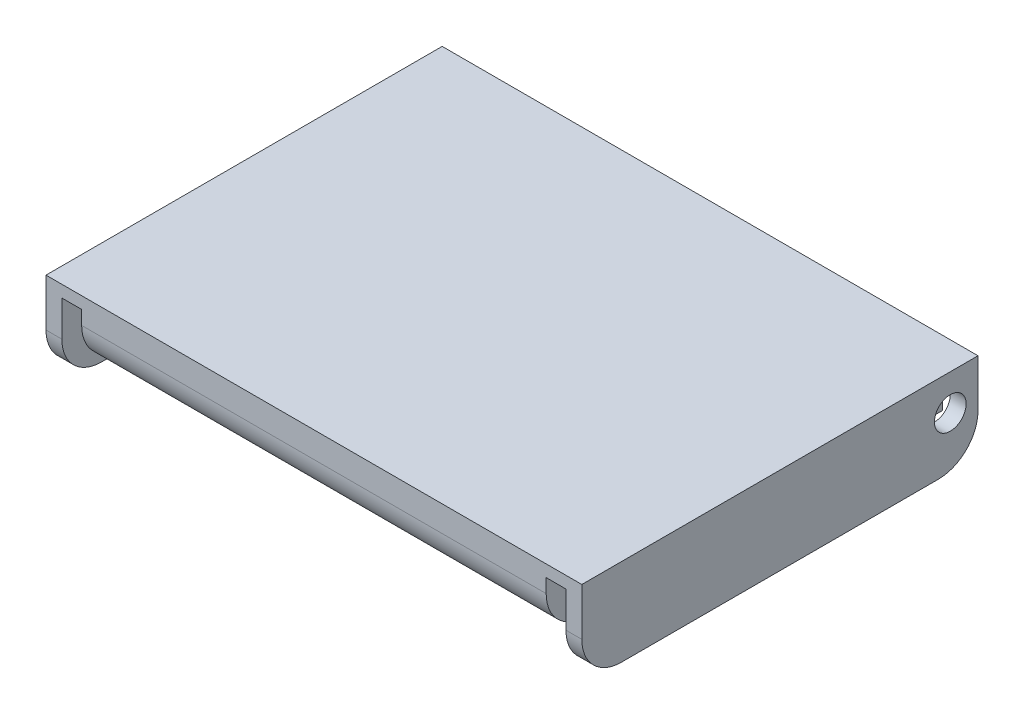
ISO-10303-21;
HEADER;
FILE_DESCRIPTION(('STEP AP214'),'2;1');
FILE_NAME('part.step','',(''),(''),'','','');
FILE_SCHEMA(('AUTOMOTIVE_DESIGN { 1 0 10303 214 1 1 1 1 }'));
ENDSEC;
DATA;
#1=APPLICATION_CONTEXT('core data for automotive mechanical design processes');
#2=APPLICATION_PROTOCOL_DEFINITION('international standard','automotive_design',2000,#1);
#3=PRODUCT_CONTEXT('',#1,'mechanical');
#4=PRODUCT('Part','Part','',(#3));
#5=PRODUCT_RELATED_PRODUCT_CATEGORY('part','',(#4));
#6=PRODUCT_DEFINITION_FORMATION('','',#4);
#7=PRODUCT_DEFINITION_CONTEXT('part definition',#1,'design');
#8=PRODUCT_DEFINITION('design','',#6,#7);
#9=PRODUCT_DEFINITION_SHAPE('','',#8);
#10=(LENGTH_UNIT() NAMED_UNIT(*) SI_UNIT(.MILLI.,.METRE.));
#11=(NAMED_UNIT(*) PLANE_ANGLE_UNIT() SI_UNIT($,.RADIAN.));
#12=(NAMED_UNIT(*) SI_UNIT($,.STERADIAN.) SOLID_ANGLE_UNIT());
#13=UNCERTAINTY_MEASURE_WITH_UNIT(LENGTH_MEASURE(1.E-05),#10,'distance_accuracy_value','');
#14=(GEOMETRIC_REPRESENTATION_CONTEXT(3) GLOBAL_UNCERTAINTY_ASSIGNED_CONTEXT((#13)) GLOBAL_UNIT_ASSIGNED_CONTEXT((#10,
#11,#12)) REPRESENTATION_CONTEXT('',''));
#15=CARTESIAN_POINT('',(0.,0.,0.));
#16=DIRECTION('',(0.,0.,1.));
#17=DIRECTION('',(1.,0.,0.));
#18=AXIS2_PLACEMENT_3D('',#15,#16,#17);
#19=CARTESIAN_POINT('',(0.,10.,-40.));
#20=DIRECTION('',(-1.,0.,0.));
#21=DIRECTION('',(0.,0.,1.));
#22=AXIS2_PLACEMENT_3D('',#19,#20,#21);
#23=CYLINDRICAL_SURFACE('',#22,10.);
#24=CARTESIAN_POINT('',(63.625,10.,-40.));
#25=DIRECTION('',(1.,0.,0.));
#26=DIRECTION('',(0.,0.,-1.));
#27=AXIS2_PLACEMENT_3D('',#24,#25,#26);
#28=CIRCLE('',#27,10.);
#29=CARTESIAN_POINT('',(63.625,10.,-50.));
#30=VERTEX_POINT('',#29);
#31=CARTESIAN_POINT('',(63.625,0.,-40.));
#32=VERTEX_POINT('',#31);
#33=EDGE_CURVE('E334',#30,#32,#28,.F.);
#34=ORIENTED_EDGE('',*,*,#33,.F.);
#35=DIRECTION('',(1.,0.,0.));
#36=VECTOR('',#35,1.);
#37=CARTESIAN_POINT('',(0.,10.,-50.));
#38=LINE('',#37,#36);
#39=CARTESIAN_POINT('',(67.625,10.,-50.));
#40=VERTEX_POINT('',#39);
#41=EDGE_CURVE('E48',#40,#30,#38,.F.);
#42=ORIENTED_EDGE('',*,*,#41,.F.);
#43=CARTESIAN_POINT('',(67.625,10.,-40.));
#44=DIRECTION('',(-1.,0.,0.));
#45=DIRECTION('',(0.,0.,1.));
#46=AXIS2_PLACEMENT_3D('',#43,#44,#45);
#47=CIRCLE('',#46,10.);
#48=CARTESIAN_POINT('',(67.625,0.,-40.));
#49=VERTEX_POINT('',#48);
#50=EDGE_CURVE('E11',#49,#40,#47,.F.);
#51=ORIENTED_EDGE('',*,*,#50,.F.);
#52=DIRECTION('',(1.,0.,0.));
#53=VECTOR('',#52,1.);
#54=CARTESIAN_POINT('',(0.,0.,-40.));
#55=LINE('',#54,#53);
#56=EDGE_CURVE('E338',#32,#49,#55,.T.);
#57=ORIENTED_EDGE('',*,*,#56,.F.);
#58=EDGE_LOOP('',(#34,#42,#51,#57));
#59=FACE_BOUND('',#58,.T.);
#60=ADVANCED_FACE('F39',(#59),#23,.T.);
#61=CARTESIAN_POINT('',(0.,10.,-40.));
#62=DIRECTION('',(-1.,0.,0.));
#63=DIRECTION('',(0.,0.,1.));
#64=AXIS2_PLACEMENT_3D('',#61,#62,#63);
#65=CYLINDRICAL_SURFACE('',#64,10.);
#66=DIRECTION('',(1.,0.,0.));
#67=VECTOR('',#66,1.);
#68=CARTESIAN_POINT('',(0.,0.,-40.));
#69=LINE('',#68,#67);
#70=CARTESIAN_POINT('',(-67.625,0.,-40.));
#71=VERTEX_POINT('',#70);
#72=CARTESIAN_POINT('',(-63.625,0.,-40.));
#73=VERTEX_POINT('',#72);
#74=EDGE_CURVE('E319',#71,#73,#69,.T.);
#75=ORIENTED_EDGE('',*,*,#74,.F.);
#76=CARTESIAN_POINT('',(-67.625,10.,-40.));
#77=DIRECTION('',(1.,0.,0.));
#78=DIRECTION('',(0.,0.,-1.));
#79=AXIS2_PLACEMENT_3D('',#76,#77,#78);
#80=CIRCLE('',#79,10.);
#81=CARTESIAN_POINT('',(-67.625,10.,-50.));
#82=VERTEX_POINT('',#81);
#83=EDGE_CURVE('E331',#82,#71,#80,.F.);
#84=ORIENTED_EDGE('',*,*,#83,.F.);
#85=DIRECTION('',(1.,0.,0.));
#86=VECTOR('',#85,1.);
#87=CARTESIAN_POINT('',(0.,10.,-50.));
#88=LINE('',#87,#86);
#89=CARTESIAN_POINT('',(-63.625,10.,-50.));
#90=VERTEX_POINT('',#89);
#91=EDGE_CURVE('E327',#90,#82,#88,.F.);
#92=ORIENTED_EDGE('',*,*,#91,.F.);
#93=CARTESIAN_POINT('',(-63.625,10.,-40.));
#94=DIRECTION('',(-1.,0.,0.));
#95=DIRECTION('',(0.,0.,1.));
#96=AXIS2_PLACEMENT_3D('',#93,#94,#95);
#97=CIRCLE('',#96,10.);
#98=EDGE_CURVE('E323',#73,#90,#97,.F.);
#99=ORIENTED_EDGE('',*,*,#98,.F.);
#100=EDGE_LOOP('',(#75,#84,#92,#99));
#101=FACE_BOUND('',#100,.T.);
#102=ADVANCED_FACE('F403',(#101),#65,.T.);
#103=CARTESIAN_POINT('',(0.,10.,40.));
#104=DIRECTION('',(1.,0.,0.));
#105=DIRECTION('',(0.,0.,-1.));
#106=AXIS2_PLACEMENT_3D('',#103,#104,#105);
#107=CYLINDRICAL_SURFACE('',#106,10.);
#108=DIRECTION('',(-1.,0.,0.));
#109=VECTOR('',#108,1.);
#110=CARTESIAN_POINT('',(0.,0.,40.));
#111=LINE('',#110,#109);
#112=CARTESIAN_POINT('',(67.625,0.,40.));
#113=VERTEX_POINT('',#112);
#114=CARTESIAN_POINT('',(63.625,0.,40.));
#115=VERTEX_POINT('',#114);
#116=EDGE_CURVE('E305',#113,#115,#111,.T.);
#117=ORIENTED_EDGE('',*,*,#116,.F.);
#118=CARTESIAN_POINT('',(67.625,10.,40.));
#119=DIRECTION('',(-1.,0.,0.));
#120=DIRECTION('',(0.,0.,1.));
#121=AXIS2_PLACEMENT_3D('',#118,#119,#120);
#122=CIRCLE('',#121,10.);
#123=CARTESIAN_POINT('',(67.625,10.,50.));
#124=VERTEX_POINT('',#123);
#125=EDGE_CURVE('E313',#124,#113,#122,.F.);
#126=ORIENTED_EDGE('',*,*,#125,.F.);
#127=DIRECTION('',(-1.,0.,0.));
#128=VECTOR('',#127,1.);
#129=CARTESIAN_POINT('',(0.,10.,50.));
#130=LINE('',#129,#128);
#131=CARTESIAN_POINT('',(63.625,10.,50.));
#132=VERTEX_POINT('',#131);
#133=EDGE_CURVE('E309',#132,#124,#130,.F.);
#134=ORIENTED_EDGE('',*,*,#133,.F.);
#135=CARTESIAN_POINT('',(63.625,10.,40.));
#136=DIRECTION('',(1.,0.,0.));
#137=DIRECTION('',(0.,0.,-1.));
#138=AXIS2_PLACEMENT_3D('',#135,#136,#137);
#139=CIRCLE('',#138,10.);
#140=EDGE_CURVE('E316',#115,#132,#139,.F.);
#141=ORIENTED_EDGE('',*,*,#140,.F.);
#142=EDGE_LOOP('',(#117,#126,#134,#141));
#143=FACE_BOUND('',#142,.T.);
#144=ADVANCED_FACE('F407',(#143),#107,.T.);
#145=CARTESIAN_POINT('',(0.,10.,40.));
#146=DIRECTION('',(1.,0.,0.));
#147=DIRECTION('',(0.,0.,-1.));
#148=AXIS2_PLACEMENT_3D('',#145,#146,#147);
#149=CYLINDRICAL_SURFACE('',#148,10.);
#150=CARTESIAN_POINT('',(-63.625,10.,40.));
#151=DIRECTION('',(-1.,0.,0.));
#152=DIRECTION('',(0.,0.,1.));
#153=AXIS2_PLACEMENT_3D('',#150,#151,#152);
#154=CIRCLE('',#153,10.);
#155=CARTESIAN_POINT('',(-63.625,10.,50.));
#156=VERTEX_POINT('',#155);
#157=CARTESIAN_POINT('',(-63.625,0.,40.));
#158=VERTEX_POINT('',#157);
#159=EDGE_CURVE('E291',#156,#158,#154,.F.);
#160=ORIENTED_EDGE('',*,*,#159,.F.);
#161=DIRECTION('',(-1.,0.,0.));
#162=VECTOR('',#161,1.);
#163=CARTESIAN_POINT('',(0.,10.,50.));
#164=LINE('',#163,#162);
#165=CARTESIAN_POINT('',(-67.625,10.,50.));
#166=VERTEX_POINT('',#165);
#167=EDGE_CURVE('E299',#166,#156,#164,.F.);
#168=ORIENTED_EDGE('',*,*,#167,.F.);
#169=CARTESIAN_POINT('',(-67.625,10.,40.));
#170=DIRECTION('',(1.,0.,0.));
#171=DIRECTION('',(0.,0.,-1.));
#172=AXIS2_PLACEMENT_3D('',#169,#170,#171);
#173=CIRCLE('',#172,10.);
#174=CARTESIAN_POINT('',(-67.625,0.,40.));
#175=VERTEX_POINT('',#174);
#176=EDGE_CURVE('E302',#175,#166,#173,.F.);
#177=ORIENTED_EDGE('',*,*,#176,.F.);
#178=DIRECTION('',(-1.,0.,0.));
#179=VECTOR('',#178,1.);
#180=CARTESIAN_POINT('',(0.,0.,40.));
#181=LINE('',#180,#179);
#182=EDGE_CURVE('E295',#158,#175,#181,.T.);
#183=ORIENTED_EDGE('',*,*,#182,.F.);
#184=EDGE_LOOP('',(#160,#168,#177,#183));
#185=FACE_BOUND('',#184,.T.);
#186=ADVANCED_FACE('F412',(#185),#149,.T.);
#187=CARTESIAN_POINT('',(-58.625,15.5,40.));
#188=DIRECTION('',(-1.,0.,0.));
#189=DIRECTION('',(0.,0.,1.));
#190=AXIS2_PLACEMENT_3D('',#187,#188,#189);
#191=CYLINDRICAL_SURFACE('',#190,10.);
#192=CARTESIAN_POINT('',(58.625,15.5,40.));
#193=DIRECTION('',(-1.,0.,0.));
#194=DIRECTION('',(0.,0.,1.));
#195=AXIS2_PLACEMENT_3D('',#192,#193,#194);
#196=CIRCLE('',#195,10.);
#197=CARTESIAN_POINT('',(58.625,15.5,50.));
#198=VERTEX_POINT('',#197);
#199=CARTESIAN_POINT('',(58.625,5.5,40.));
#200=VERTEX_POINT('',#199);
#201=EDGE_CURVE('E279',#198,#200,#196,.F.);
#202=ORIENTED_EDGE('',*,*,#201,.F.);
#203=DIRECTION('',(-1.,0.,0.));
#204=VECTOR('',#203,1.);
#205=CARTESIAN_POINT('',(67.625,15.5,50.));
#206=LINE('',#205,#204);
#207=CARTESIAN_POINT('',(-58.625,15.5,50.));
#208=VERTEX_POINT('',#207);
#209=EDGE_CURVE('E288',#208,#198,#206,.F.);
#210=ORIENTED_EDGE('',*,*,#209,.F.);
#211=CARTESIAN_POINT('',(-58.625,15.5,40.));
#212=DIRECTION('',(1.,0.,0.));
#213=DIRECTION('',(0.,0.,-1.));
#214=AXIS2_PLACEMENT_3D('',#211,#212,#213);
#215=CIRCLE('',#214,10.);
#216=CARTESIAN_POINT('',(-58.625,5.5,40.));
#217=VERTEX_POINT('',#216);
#218=EDGE_CURVE('E285',#217,#208,#215,.F.);
#219=ORIENTED_EDGE('',*,*,#218,.F.);
#220=DIRECTION('',(-1.,0.,0.));
#221=VECTOR('',#220,1.);
#222=CARTESIAN_POINT('',(-58.625,5.5,40.));
#223=LINE('',#222,#221);
#224=EDGE_CURVE('E163',#200,#217,#223,.T.);
#225=ORIENTED_EDGE('',*,*,#224,.F.);
#226=EDGE_LOOP('',(#202,#210,#219,#225));
#227=FACE_BOUND('',#226,.T.);
#228=ADVANCED_FACE('F419',(#227),#191,.T.);
#229=CARTESIAN_POINT('',(0.,0.,0.));
#230=DIRECTION('',(0.,-1.,0.));
#231=DIRECTION('',(0.,0.,-1.));
#232=AXIS2_PLACEMENT_3D('',#229,#230,#231);
#233=PLANE('',#232);
#234=DIRECTION('',(0.,0.,1.));
#235=VECTOR('',#234,1.);
#236=CARTESIAN_POINT('',(63.625,0.,-50.));
#237=LINE('',#236,#235);
#238=EDGE_CURVE('E205',#32,#115,#237,.T.);
#239=ORIENTED_EDGE('',*,*,#238,.F.);
#240=ORIENTED_EDGE('',*,*,#56,.T.);
#241=DIRECTION('',(0.,0.,-1.));
#242=VECTOR('',#241,1.);
#243=CARTESIAN_POINT('',(67.625,0.,-50.));
#244=LINE('',#243,#242);
#245=EDGE_CURVE('E251',#113,#49,#244,.T.);
#246=ORIENTED_EDGE('',*,*,#245,.F.);
#247=ORIENTED_EDGE('',*,*,#116,.T.);
#248=EDGE_LOOP('',(#239,#240,#246,#247));
#249=FACE_BOUND('',#248,.T.);
#250=ADVANCED_FACE('F423',(#249),#233,.T.);
#251=CARTESIAN_POINT('',(-67.625,22.,-50.));
#252=DIRECTION('',(1.,0.,0.));
#253=DIRECTION('',(0.,0.,-1.));
#254=AXIS2_PLACEMENT_3D('',#251,#252,#253);
#255=PLANE('',#254);
#256=CARTESIAN_POINT('',(-67.625,13.,-43.));
#257=DIRECTION('',(-1.,0.,0.));
#258=DIRECTION('',(0.,0.,1.));
#259=AXIS2_PLACEMENT_3D('',#256,#257,#258);
#260=CIRCLE('',#259,4.);
#261=CARTESIAN_POINT('',(-67.625,13.,-39.));
#262=VERTEX_POINT('',#261);
#263=EDGE_CURVE('E371',#262,#262,#260,.T.);
#264=ORIENTED_EDGE('',*,*,#263,.F.);
#265=EDGE_LOOP('',(#264));
#266=FACE_BOUND('',#265,.T.);
#267=DIRECTION('',(0.,-1.,0.));
#268=VECTOR('',#267,1.);
#269=CARTESIAN_POINT('',(-67.625,22.,-50.));
#270=LINE('',#269,#268);
#271=CARTESIAN_POINT('',(-67.625,22.,-50.));
#272=VERTEX_POINT('',#271);
#273=EDGE_CURVE('E260',#272,#82,#270,.T.);
#274=ORIENTED_EDGE('',*,*,#273,.T.);
#275=ORIENTED_EDGE('',*,*,#83,.T.);
#276=DIRECTION('',(0.,0.,1.));
#277=VECTOR('',#276,1.);
#278=CARTESIAN_POINT('',(-67.625,0.,-50.));
#279=LINE('',#278,#277);
#280=EDGE_CURVE('E212',#71,#175,#279,.T.);
#281=ORIENTED_EDGE('',*,*,#280,.T.);
#282=ORIENTED_EDGE('',*,*,#176,.T.);
#283=DIRECTION('',(0.,-1.,0.));
#284=VECTOR('',#283,1.);
#285=CARTESIAN_POINT('',(-67.625,22.,50.));
#286=LINE('',#285,#284);
#287=CARTESIAN_POINT('',(-67.625,22.,50.));
#288=VERTEX_POINT('',#287);
#289=EDGE_CURVE('E275',#288,#166,#286,.T.);
#290=ORIENTED_EDGE('',*,*,#289,.F.);
#291=DIRECTION('',(0.,0.,1.));
#292=VECTOR('',#291,1.);
#293=CARTESIAN_POINT('',(-67.625,22.,-50.));
#294=LINE('',#293,#292);
#295=EDGE_CURVE('E246',#272,#288,#294,.T.);
#296=ORIENTED_EDGE('',*,*,#295,.F.);
#297=EDGE_LOOP('',(#274,#275,#281,#282,#290,#296));
#298=FACE_BOUND('',#297,.T.);
#299=ADVANCED_FACE('F425',(#266,#298),#255,.F.);
#300=CARTESIAN_POINT('',(67.625,22.,50.));
#301=DIRECTION('',(0.,0.,-1.));
#302=DIRECTION('',(-1.,0.,0.));
#303=AXIS2_PLACEMENT_3D('',#300,#301,#302);
#304=PLANE('',#303);
#305=DIRECTION('',(0.,1.,0.));
#306=VECTOR('',#305,1.);
#307=CARTESIAN_POINT('',(63.625,19.,50.));
#308=LINE('',#307,#306);
#309=CARTESIAN_POINT('',(63.625,19.,50.));
#310=VERTEX_POINT('',#309);
#311=EDGE_CURVE('E228',#132,#310,#308,.T.);
#312=ORIENTED_EDGE('',*,*,#311,.F.);
#313=ORIENTED_EDGE('',*,*,#133,.T.);
#314=DIRECTION('',(0.,-1.,0.));
#315=VECTOR('',#314,1.);
#316=CARTESIAN_POINT('',(67.625,22.,50.));
#317=LINE('',#316,#315);
#318=CARTESIAN_POINT('',(67.625,22.,50.));
#319=VERTEX_POINT('',#318);
#320=EDGE_CURVE('E271',#319,#124,#317,.T.);
#321=ORIENTED_EDGE('',*,*,#320,.F.);
#322=DIRECTION('',(1.,0.,0.));
#323=VECTOR('',#322,1.);
#324=CARTESIAN_POINT('',(67.625,22.,50.));
#325=LINE('',#324,#323);
#326=EDGE_CURVE('E250',#288,#319,#325,.T.);
#327=ORIENTED_EDGE('',*,*,#326,.F.);
#328=ORIENTED_EDGE('',*,*,#289,.T.);
#329=ORIENTED_EDGE('',*,*,#167,.T.);
#330=DIRECTION('',(0.,-1.,0.));
#331=VECTOR('',#330,1.);
#332=CARTESIAN_POINT('',(-63.625,19.,50.));
#333=LINE('',#332,#331);
#334=CARTESIAN_POINT('',(-63.625,19.,50.));
#335=VERTEX_POINT('',#334);
#336=EDGE_CURVE('E188',#335,#156,#333,.T.);
#337=ORIENTED_EDGE('',*,*,#336,.F.);
#338=DIRECTION('',(-1.,0.,0.));
#339=VECTOR('',#338,1.);
#340=CARTESIAN_POINT('',(-63.625,19.,50.));
#341=LINE('',#340,#339);
#342=CARTESIAN_POINT('',(-58.625,19.,50.));
#343=VERTEX_POINT('',#342);
#344=EDGE_CURVE('E195',#343,#335,#341,.T.);
#345=ORIENTED_EDGE('',*,*,#344,.F.);
#346=DIRECTION('',(0.,1.,0.));
#347=VECTOR('',#346,1.);
#348=CARTESIAN_POINT('',(-58.625,19.,50.));
#349=LINE('',#348,#347);
#350=EDGE_CURVE('E202',#208,#343,#349,.T.);
#351=ORIENTED_EDGE('',*,*,#350,.F.);
#352=ORIENTED_EDGE('',*,*,#209,.T.);
#353=DIRECTION('',(0.,-1.,0.));
#354=VECTOR('',#353,1.);
#355=CARTESIAN_POINT('',(58.625,19.,50.));
#356=LINE('',#355,#354);
#357=CARTESIAN_POINT('',(58.625,19.,50.));
#358=VERTEX_POINT('',#357);
#359=EDGE_CURVE('E222',#358,#198,#356,.T.);
#360=ORIENTED_EDGE('',*,*,#359,.F.);
#361=DIRECTION('',(-1.,0.,0.));
#362=VECTOR('',#361,1.);
#363=CARTESIAN_POINT('',(63.625,19.,50.));
#364=LINE('',#363,#362);
#365=EDGE_CURVE('E231',#310,#358,#364,.T.);
#366=ORIENTED_EDGE('',*,*,#365,.F.);
#367=EDGE_LOOP('',(#312,#313,#321,#327,#328,#329,#337,#345,#351,#352,#360,#366));
#368=FACE_BOUND('',#367,.T.);
#369=ADVANCED_FACE('F428',(#368),#304,.F.);
#370=CARTESIAN_POINT('',(67.625,22.,-50.));
#371=DIRECTION('',(-1.,0.,0.));
#372=DIRECTION('',(0.,0.,1.));
#373=AXIS2_PLACEMENT_3D('',#370,#371,#372);
#374=PLANE('',#373);
#375=CARTESIAN_POINT('',(67.625,13.,-43.));
#376=DIRECTION('',(-1.,0.,0.));
#377=DIRECTION('',(0.,0.,1.));
#378=AXIS2_PLACEMENT_3D('',#375,#376,#377);
#379=CIRCLE('',#378,4.);
#380=CARTESIAN_POINT('',(67.625,13.,-39.));
#381=VERTEX_POINT('',#380);
#382=EDGE_CURVE('E375',#381,#381,#379,.T.);
#383=ORIENTED_EDGE('',*,*,#382,.T.);
#384=EDGE_LOOP('',(#383));
#385=FACE_BOUND('',#384,.T.);
#386=ORIENTED_EDGE('',*,*,#245,.T.);
#387=ORIENTED_EDGE('',*,*,#50,.T.);
#388=DIRECTION('',(0.,-1.,0.));
#389=VECTOR('',#388,1.);
#390=CARTESIAN_POINT('',(67.625,22.,-50.));
#391=LINE('',#390,#389);
#392=CARTESIAN_POINT('',(67.625,22.,-50.));
#393=VERTEX_POINT('',#392);
#394=EDGE_CURVE('E268',#393,#40,#391,.T.);
#395=ORIENTED_EDGE('',*,*,#394,.F.);
#396=DIRECTION('',(0.,0.,-1.));
#397=VECTOR('',#396,1.);
#398=CARTESIAN_POINT('',(67.625,22.,-50.));
#399=LINE('',#398,#397);
#400=EDGE_CURVE('E254',#319,#393,#399,.T.);
#401=ORIENTED_EDGE('',*,*,#400,.F.);
#402=ORIENTED_EDGE('',*,*,#320,.T.);
#403=ORIENTED_EDGE('',*,*,#125,.T.);
#404=EDGE_LOOP('',(#386,#387,#395,#401,#402,#403));
#405=FACE_BOUND('',#404,.T.);
#406=ADVANCED_FACE('F432',(#385,#405),#374,.F.);
#407=CARTESIAN_POINT('',(67.625,22.,-50.));
#408=DIRECTION('',(0.,0.,1.));
#409=DIRECTION('',(1.,0.,0.));
#410=AXIS2_PLACEMENT_3D('',#407,#408,#409);
#411=PLANE('',#410);
#412=ORIENTED_EDGE('',*,*,#394,.T.);
#413=ORIENTED_EDGE('',*,*,#41,.T.);
#414=DIRECTION('',(0.,1.,0.));
#415=VECTOR('',#414,1.);
#416=CARTESIAN_POINT('',(63.625,19.,-50.));
#417=LINE('',#416,#415);
#418=CARTESIAN_POINT('',(63.625,19.,-50.));
#419=VERTEX_POINT('',#418);
#420=EDGE_CURVE('E218',#30,#419,#417,.T.);
#421=ORIENTED_EDGE('',*,*,#420,.T.);
#422=DIRECTION('',(-1.,0.,0.));
#423=VECTOR('',#422,1.);
#424=CARTESIAN_POINT('',(63.625,19.,-50.));
#425=LINE('',#424,#423);
#426=CARTESIAN_POINT('',(58.625,19.,-50.));
#427=VERTEX_POINT('',#426);
#428=EDGE_CURVE('E221',#419,#427,#425,.T.);
#429=ORIENTED_EDGE('',*,*,#428,.T.);
#430=DIRECTION('',(0.,-1.,0.));
#431=VECTOR('',#430,1.);
#432=CARTESIAN_POINT('',(58.625,19.,-50.));
#433=LINE('',#432,#431);
#434=CARTESIAN_POINT('',(58.625,5.5,-50.));
#435=VERTEX_POINT('',#434);
#436=EDGE_CURVE('E178',#427,#435,#433,.T.);
#437=ORIENTED_EDGE('',*,*,#436,.T.);
#438=DIRECTION('',(1.,0.,0.));
#439=VECTOR('',#438,1.);
#440=CARTESIAN_POINT('',(-58.625,5.5,-50.));
#441=LINE('',#440,#439);
#442=CARTESIAN_POINT('',(-58.625,5.5,-50.));
#443=VERTEX_POINT('',#442);
#444=EDGE_CURVE('E161',#443,#435,#441,.T.);
#445=ORIENTED_EDGE('',*,*,#444,.F.);
#446=DIRECTION('',(0.,1.,0.));
#447=VECTOR('',#446,1.);
#448=CARTESIAN_POINT('',(-58.625,19.,-50.));
#449=LINE('',#448,#447);
#450=CARTESIAN_POINT('',(-58.625,19.,-50.));
#451=VERTEX_POINT('',#450);
#452=EDGE_CURVE('E174',#443,#451,#449,.T.);
#453=ORIENTED_EDGE('',*,*,#452,.T.);
#454=DIRECTION('',(-1.,0.,0.));
#455=VECTOR('',#454,1.);
#456=CARTESIAN_POINT('',(-63.625,19.,-50.));
#457=LINE('',#456,#455);
#458=CARTESIAN_POINT('',(-63.625,19.,-50.));
#459=VERTEX_POINT('',#458);
#460=EDGE_CURVE('E187',#451,#459,#457,.T.);
#461=ORIENTED_EDGE('',*,*,#460,.T.);
#462=DIRECTION('',(0.,-1.,0.));
#463=VECTOR('',#462,1.);
#464=CARTESIAN_POINT('',(-63.625,19.,-50.));
#465=LINE('',#464,#463);
#466=EDGE_CURVE('E192',#459,#90,#465,.T.);
#467=ORIENTED_EDGE('',*,*,#466,.T.);
#468=ORIENTED_EDGE('',*,*,#91,.T.);
#469=ORIENTED_EDGE('',*,*,#273,.F.);
#470=DIRECTION('',(-1.,0.,0.));
#471=VECTOR('',#470,1.);
#472=CARTESIAN_POINT('',(67.625,22.,-50.));
#473=LINE('',#472,#471);
#474=EDGE_CURVE('E257',#393,#272,#473,.T.);
#475=ORIENTED_EDGE('',*,*,#474,.F.);
#476=EDGE_LOOP('',(#412,#413,#421,#429,#437,#445,#453,#461,#467,#468,#469,#475));
#477=FACE_BOUND('',#476,.T.);
#478=ADVANCED_FACE('F172',(#477),#411,.F.);
#479=CARTESIAN_POINT('',(0.,22.,0.));
#480=DIRECTION('',(0.,-1.,0.));
#481=DIRECTION('',(0.,0.,-1.));
#482=AXIS2_PLACEMENT_3D('',#479,#480,#481);
#483=PLANE('',#482);
#484=ORIENTED_EDGE('',*,*,#295,.T.);
#485=ORIENTED_EDGE('',*,*,#326,.T.);
#486=ORIENTED_EDGE('',*,*,#400,.T.);
#487=ORIENTED_EDGE('',*,*,#474,.T.);
#488=EDGE_LOOP('',(#484,#485,#486,#487));
#489=FACE_BOUND('',#488,.T.);
#490=ADVANCED_FACE('F438',(#489),#483,.F.);
#491=ORIENTED_EDGE('',*,*,#280,.F.);
#492=ORIENTED_EDGE('',*,*,#74,.T.);
#493=DIRECTION('',(0.,0.,1.));
#494=VECTOR('',#493,1.);
#495=CARTESIAN_POINT('',(-63.625,0.,-50.));
#496=LINE('',#495,#494);
#497=EDGE_CURVE('E209',#73,#158,#496,.T.);
#498=ORIENTED_EDGE('',*,*,#497,.T.);
#499=ORIENTED_EDGE('',*,*,#182,.T.);
#500=EDGE_LOOP('',(#491,#492,#498,#499));
#501=FACE_BOUND('',#500,.T.);
#502=ADVANCED_FACE('F439',(#501),#233,.T.);
#503=CARTESIAN_POINT('',(63.625,19.,-50.));
#504=DIRECTION('',(1.,0.,0.));
#505=DIRECTION('',(0.,0.,-1.));
#506=AXIS2_PLACEMENT_3D('',#503,#504,#505);
#507=PLANE('',#506);
#508=CARTESIAN_POINT('',(63.625,13.,-43.));
#509=DIRECTION('',(1.,0.,0.));
#510=DIRECTION('',(0.,0.,-1.));
#511=AXIS2_PLACEMENT_3D('',#508,#509,#510);
#512=CIRCLE('',#511,4.);
#513=CARTESIAN_POINT('',(63.625,13.,-47.));
#514=VERTEX_POINT('',#513);
#515=EDGE_CURVE('E180',#514,#514,#512,.T.);
#516=ORIENTED_EDGE('',*,*,#515,.T.);
#517=EDGE_LOOP('',(#516));
#518=FACE_BOUND('',#517,.T.);
#519=ORIENTED_EDGE('',*,*,#420,.F.);
#520=ORIENTED_EDGE('',*,*,#33,.T.);
#521=ORIENTED_EDGE('',*,*,#238,.T.);
#522=ORIENTED_EDGE('',*,*,#140,.T.);
#523=ORIENTED_EDGE('',*,*,#311,.T.);
#524=DIRECTION('',(0.,0.,1.));
#525=VECTOR('',#524,1.);
#526=CARTESIAN_POINT('',(63.625,19.,-50.));
#527=LINE('',#526,#525);
#528=EDGE_CURVE('E227',#419,#310,#527,.T.);
#529=ORIENTED_EDGE('',*,*,#528,.F.);
#530=EDGE_LOOP('',(#519,#520,#521,#522,#523,#529));
#531=FACE_BOUND('',#530,.T.);
#532=ADVANCED_FACE('F348',(#518,#531),#507,.F.);
#533=CARTESIAN_POINT('',(58.625,19.,-50.));
#534=DIRECTION('',(-1.,0.,0.));
#535=DIRECTION('',(0.,0.,1.));
#536=AXIS2_PLACEMENT_3D('',#533,#534,#535);
#537=PLANE('',#536);
#538=CARTESIAN_POINT('',(58.625,13.,-43.));
#539=DIRECTION('',(-1.,0.,0.));
#540=DIRECTION('',(0.,0.,1.));
#541=AXIS2_PLACEMENT_3D('',#538,#539,#540);
#542=CIRCLE('',#541,4.);
#543=CARTESIAN_POINT('',(58.625,13.,-39.));
#544=VERTEX_POINT('',#543);
#545=EDGE_CURVE('E363',#544,#544,#542,.T.);
#546=ORIENTED_EDGE('',*,*,#545,.T.);
#547=EDGE_LOOP('',(#546));
#548=FACE_BOUND('',#547,.T.);
#549=ORIENTED_EDGE('',*,*,#359,.T.);
#550=ORIENTED_EDGE('',*,*,#201,.T.);
#551=DIRECTION('',(0.,0.,-1.));
#552=VECTOR('',#551,1.);
#553=CARTESIAN_POINT('',(58.625,5.5,50.));
#554=LINE('',#553,#552);
#555=EDGE_CURVE('E168',#200,#435,#554,.T.);
#556=ORIENTED_EDGE('',*,*,#555,.T.);
#557=ORIENTED_EDGE('',*,*,#436,.F.);
#558=DIRECTION('',(0.,0.,1.));
#559=VECTOR('',#558,1.);
#560=CARTESIAN_POINT('',(58.625,19.,-50.));
#561=LINE('',#560,#559);
#562=EDGE_CURVE('E240',#427,#358,#561,.T.);
#563=ORIENTED_EDGE('',*,*,#562,.T.);
#564=EDGE_LOOP('',(#549,#550,#556,#557,#563));
#565=FACE_BOUND('',#564,.T.);
#566=ADVANCED_FACE('F356',(#548,#565),#537,.F.);
#567=CARTESIAN_POINT('',(63.625,19.,-50.));
#568=DIRECTION('',(0.,1.,0.));
#569=DIRECTION('',(0.,0.,1.));
#570=AXIS2_PLACEMENT_3D('',#567,#568,#569);
#571=PLANE('',#570);
#572=ORIENTED_EDGE('',*,*,#365,.T.);
#573=ORIENTED_EDGE('',*,*,#562,.F.);
#574=ORIENTED_EDGE('',*,*,#428,.F.);
#575=ORIENTED_EDGE('',*,*,#528,.T.);
#576=EDGE_LOOP('',(#572,#573,#574,#575));
#577=FACE_BOUND('',#576,.T.);
#578=ADVANCED_FACE('F353',(#577),#571,.F.);
#579=CARTESIAN_POINT('',(-58.625,19.,-50.));
#580=DIRECTION('',(1.,0.,0.));
#581=DIRECTION('',(0.,0.,-1.));
#582=AXIS2_PLACEMENT_3D('',#579,#580,#581);
#583=PLANE('',#582);
#584=CARTESIAN_POINT('',(-58.625,13.,-43.));
#585=DIRECTION('',(1.,0.,0.));
#586=DIRECTION('',(0.,0.,-1.));
#587=AXIS2_PLACEMENT_3D('',#584,#585,#586);
#588=CIRCLE('',#587,4.);
#589=CARTESIAN_POINT('',(-58.625,13.,-47.));
#590=VERTEX_POINT('',#589);
#591=EDGE_CURVE('E367',#590,#590,#588,.T.);
#592=ORIENTED_EDGE('',*,*,#591,.T.);
#593=EDGE_LOOP('',(#592));
#594=FACE_BOUND('',#593,.T.);
#595=DIRECTION('',(0.,0.,-1.));
#596=VECTOR('',#595,1.);
#597=CARTESIAN_POINT('',(-58.625,5.5,50.));
#598=LINE('',#597,#596);
#599=EDGE_CURVE('E157',#217,#443,#598,.T.);
#600=ORIENTED_EDGE('',*,*,#599,.F.);
#601=ORIENTED_EDGE('',*,*,#218,.T.);
#602=ORIENTED_EDGE('',*,*,#350,.T.);
#603=DIRECTION('',(0.,0.,1.));
#604=VECTOR('',#603,1.);
#605=CARTESIAN_POINT('',(-58.625,19.,-50.));
#606=LINE('',#605,#604);
#607=EDGE_CURVE('E184',#451,#343,#606,.T.);
#608=ORIENTED_EDGE('',*,*,#607,.F.);
#609=ORIENTED_EDGE('',*,*,#452,.F.);
#610=EDGE_LOOP('',(#600,#601,#602,#608,#609));
#611=FACE_BOUND('',#610,.T.);
#612=ADVANCED_FACE('F182',(#594,#611),#583,.F.);
#613=CARTESIAN_POINT('',(-63.625,19.,-50.));
#614=DIRECTION('',(-1.,0.,0.));
#615=DIRECTION('',(0.,0.,1.));
#616=AXIS2_PLACEMENT_3D('',#613,#614,#615);
#617=PLANE('',#616);
#618=CARTESIAN_POINT('',(-63.625,13.,-43.));
#619=DIRECTION('',(-1.,0.,0.));
#620=DIRECTION('',(0.,0.,1.));
#621=AXIS2_PLACEMENT_3D('',#618,#619,#620);
#622=CIRCLE('',#621,4.);
#623=CARTESIAN_POINT('',(-63.625,13.,-39.));
#624=VERTEX_POINT('',#623);
#625=EDGE_CURVE('E42',#624,#624,#622,.T.);
#626=ORIENTED_EDGE('',*,*,#625,.T.);
#627=EDGE_LOOP('',(#626));
#628=FACE_BOUND('',#627,.T.);
#629=ORIENTED_EDGE('',*,*,#497,.F.);
#630=ORIENTED_EDGE('',*,*,#98,.T.);
#631=ORIENTED_EDGE('',*,*,#466,.F.);
#632=DIRECTION('',(0.,0.,1.));
#633=VECTOR('',#632,1.);
#634=CARTESIAN_POINT('',(-63.625,19.,-50.));
#635=LINE('',#634,#633);
#636=EDGE_CURVE('E213',#459,#335,#635,.T.);
#637=ORIENTED_EDGE('',*,*,#636,.T.);
#638=ORIENTED_EDGE('',*,*,#336,.T.);
#639=ORIENTED_EDGE('',*,*,#159,.T.);
#640=EDGE_LOOP('',(#629,#630,#631,#637,#638,#639));
#641=FACE_BOUND('',#640,.T.);
#642=ADVANCED_FACE('F384',(#628,#641),#617,.F.);
#643=CARTESIAN_POINT('',(-63.625,19.,-50.));
#644=DIRECTION('',(0.,1.,0.));
#645=DIRECTION('',(0.,0.,1.));
#646=AXIS2_PLACEMENT_3D('',#643,#644,#645);
#647=PLANE('',#646);
#648=ORIENTED_EDGE('',*,*,#344,.T.);
#649=ORIENTED_EDGE('',*,*,#636,.F.);
#650=ORIENTED_EDGE('',*,*,#460,.F.);
#651=ORIENTED_EDGE('',*,*,#607,.T.);
#652=EDGE_LOOP('',(#648,#649,#650,#651));
#653=FACE_BOUND('',#652,.T.);
#654=ADVANCED_FACE('F398',(#653),#647,.F.);
#655=CARTESIAN_POINT('',(-58.625,5.5,50.));
#656=DIRECTION('',(0.,1.,0.));
#657=DIRECTION('',(0.,0.,1.));
#658=AXIS2_PLACEMENT_3D('',#655,#656,#657);
#659=PLANE('',#658);
#660=ORIENTED_EDGE('',*,*,#555,.F.);
#661=ORIENTED_EDGE('',*,*,#224,.T.);
#662=ORIENTED_EDGE('',*,*,#599,.T.);
#663=ORIENTED_EDGE('',*,*,#444,.T.);
#664=EDGE_LOOP('',(#660,#661,#662,#663));
#665=FACE_BOUND('',#664,.T.);
#666=ADVANCED_FACE('F160',(#665),#659,.F.);
#667=CARTESIAN_POINT('',(67.625,13.,-43.));
#668=DIRECTION('',(-1.,0.,0.));
#669=DIRECTION('',(0.,0.,1.));
#670=AXIS2_PLACEMENT_3D('',#667,#668,#669);
#671=CYLINDRICAL_SURFACE('',#670,4.);
#672=ORIENTED_EDGE('',*,*,#263,.T.);
#673=EDGE_LOOP('',(#672));
#674=FACE_BOUND('',#673,.T.);
#675=ORIENTED_EDGE('',*,*,#625,.F.);
#676=EDGE_LOOP('',(#675));
#677=FACE_BOUND('',#676,.T.);
#678=ADVANCED_FACE('F387',(#674,#677),#671,.F.);
#679=ORIENTED_EDGE('',*,*,#591,.F.);
#680=EDGE_LOOP('',(#679));
#681=FACE_BOUND('',#680,.T.);
#682=ORIENTED_EDGE('',*,*,#545,.F.);
#683=EDGE_LOOP('',(#682));
#684=FACE_BOUND('',#683,.T.);
#685=ADVANCED_FACE('F389',(#681,#684),#671,.F.);
#686=ORIENTED_EDGE('',*,*,#382,.F.);
#687=EDGE_LOOP('',(#686));
#688=FACE_BOUND('',#687,.T.);
#689=ORIENTED_EDGE('',*,*,#515,.F.);
#690=EDGE_LOOP('',(#689));
#691=FACE_BOUND('',#690,.T.);
#692=ADVANCED_FACE('F392',(#688,#691),#671,.F.);
#693=CLOSED_SHELL('',(#60,#102,#144,#186,#228,#250,#299,#369,#406,#478,#490,#502,#532,#566,#578,
#612,#642,#654,#666,#678,#685,#692));
#694=MANIFOLD_SOLID_BREP('B2',#693);
#695=ADVANCED_BREP_SHAPE_REPRESENTATION('',(#18,#694),#14);
#696=SHAPE_DEFINITION_REPRESENTATION(#9,#695);
ENDSEC;
END-ISO-10303-21;
